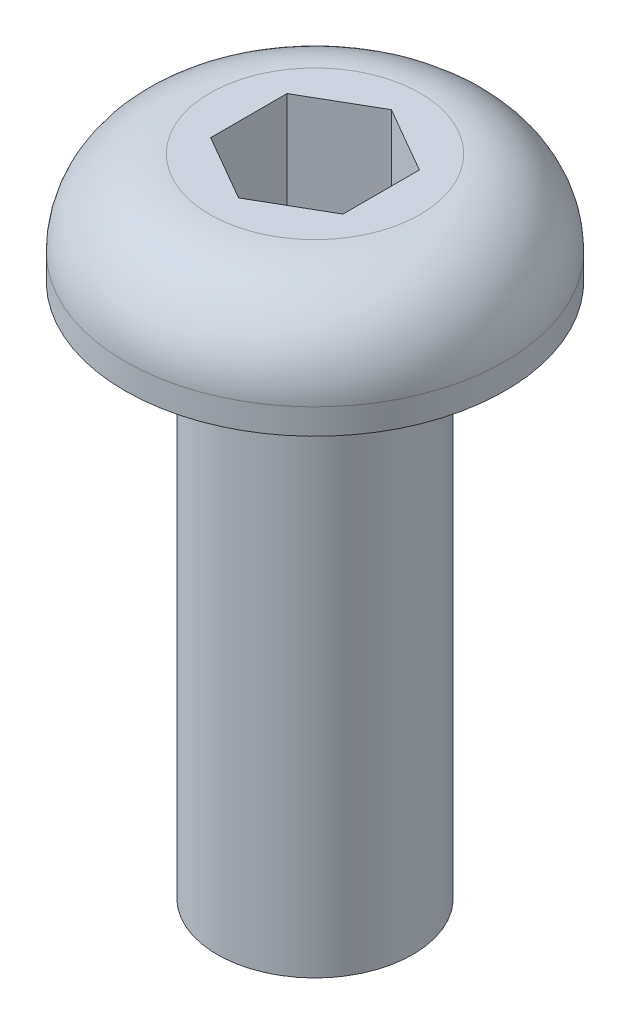
ISO-10303-21;
HEADER;
FILE_DESCRIPTION(('STEP AP214'),'2;1');
FILE_NAME('part.step','',(''),(''),'','','');
FILE_SCHEMA(('AUTOMOTIVE_DESIGN { 1 0 10303 214 1 1 1 1 }'));
ENDSEC;
DATA;
#1=APPLICATION_CONTEXT('core data for automotive mechanical design processes');
#2=APPLICATION_PROTOCOL_DEFINITION('international standard','automotive_design',2000,#1);
#3=PRODUCT_CONTEXT('',#1,'mechanical');
#4=PRODUCT('Part','Part','',(#3));
#5=PRODUCT_RELATED_PRODUCT_CATEGORY('part','',(#4));
#6=PRODUCT_DEFINITION_FORMATION('','',#4);
#7=PRODUCT_DEFINITION_CONTEXT('part definition',#1,'design');
#8=PRODUCT_DEFINITION('design','',#6,#7);
#9=PRODUCT_DEFINITION_SHAPE('','',#8);
#10=(LENGTH_UNIT() NAMED_UNIT(*) SI_UNIT(.MILLI.,.METRE.));
#11=(NAMED_UNIT(*) PLANE_ANGLE_UNIT() SI_UNIT($,.RADIAN.));
#12=(NAMED_UNIT(*) SI_UNIT($,.STERADIAN.) SOLID_ANGLE_UNIT());
#13=UNCERTAINTY_MEASURE_WITH_UNIT(LENGTH_MEASURE(1.E-05),#10,'distance_accuracy_value','');
#14=(GEOMETRIC_REPRESENTATION_CONTEXT(3) GLOBAL_UNCERTAINTY_ASSIGNED_CONTEXT((#13)) GLOBAL_UNIT_ASSIGNED_CONTEXT((#10,
#11,#12)) REPRESENTATION_CONTEXT('',''));
#15=CARTESIAN_POINT('',(0.,0.,0.));
#16=DIRECTION('',(0.,0.,1.));
#17=DIRECTION('',(1.,0.,0.));
#18=AXIS2_PLACEMENT_3D('',#15,#16,#17);
#19=CARTESIAN_POINT('',(0.,0.,0.));
#20=DIRECTION('',(0.,1.,0.));
#21=DIRECTION('',(0.,0.,1.));
#22=AXIS2_PLACEMENT_3D('',#19,#20,#21);
#23=PLANE('',#22);
#24=DIRECTION('',(0.,0.,1.));
#25=VECTOR('',#24,1.);
#26=CARTESIAN_POINT('',(-0.9906,0.,-0.571923176659243));
#27=LINE('',#26,#25);
#28=CARTESIAN_POINT('',(-0.990600000000001,0.,-0.571923176659244));
#29=VERTEX_POINT('',#28);
#30=CARTESIAN_POINT('',(-0.9906,0.,0.571923176659244));
#31=VERTEX_POINT('',#30);
#32=EDGE_CURVE('E97',#29,#31,#27,.T.);
#33=ORIENTED_EDGE('',*,*,#32,.T.);
#34=DIRECTION('',(0.866025403784439,0.,0.5));
#35=VECTOR('',#34,1.);
#36=CARTESIAN_POINT('',(-0.9906,0.,0.571923176659244));
#37=LINE('',#36,#35);
#38=CARTESIAN_POINT('',(0.,0.,1.14384635331849));
#39=VERTEX_POINT('',#38);
#40=EDGE_CURVE('E79',#31,#39,#37,.T.);
#41=ORIENTED_EDGE('',*,*,#40,.T.);
#42=DIRECTION('',(0.866025403784439,0.,-0.5));
#43=VECTOR('',#42,1.);
#44=CARTESIAN_POINT('',(0.,0.,1.14384635331849));
#45=LINE('',#44,#43);
#46=CARTESIAN_POINT('',(0.990600000000001,0.,0.571923176659244));
#47=VERTEX_POINT('',#46);
#48=EDGE_CURVE('E85',#39,#47,#45,.T.);
#49=ORIENTED_EDGE('',*,*,#48,.T.);
#50=DIRECTION('',(0.,0.,-1.));
#51=VECTOR('',#50,1.);
#52=CARTESIAN_POINT('',(0.9906,0.,0.571923176659243));
#53=LINE('',#52,#51);
#54=CARTESIAN_POINT('',(0.990599999999999,0.,-0.571923176659244));
#55=VERTEX_POINT('',#54);
#56=EDGE_CURVE('E155',#47,#55,#53,.T.);
#57=ORIENTED_EDGE('',*,*,#56,.T.);
#58=DIRECTION('',(-0.866025403784439,0.,-0.5));
#59=VECTOR('',#58,1.);
#60=CARTESIAN_POINT('',(0.990599999999999,0.,-0.571923176659244));
#61=LINE('',#60,#59);
#62=CARTESIAN_POINT('',(0.,0.,-1.14384635331849));
#63=VERTEX_POINT('',#62);
#64=EDGE_CURVE('E167',#55,#63,#61,.T.);
#65=ORIENTED_EDGE('',*,*,#64,.T.);
#66=DIRECTION('',(-0.866025403784439,0.,0.5));
#67=VECTOR('',#66,1.);
#68=CARTESIAN_POINT('',(0.,0.,-1.14384635331849));
#69=LINE('',#68,#67);
#70=EDGE_CURVE('E174',#63,#29,#69,.T.);
#71=ORIENTED_EDGE('',*,*,#70,.T.);
#72=EDGE_LOOP('',(#33,#41,#49,#57,#65,#71));
#73=FACE_BOUND('',#72,.T.);
#74=ADVANCED_FACE('F16',(#73),#23,.T.);
#75=CARTESIAN_POINT('',(0.,0.,1.14384635331849));
#76=DIRECTION('',(0.5,0.,0.866025403784439));
#77=DIRECTION('',(0.866025403784439,0.,-0.5));
#78=AXIS2_PLACEMENT_3D('',#75,#76,#77);
#79=PLANE('',#78);
#80=DIRECTION('',(0.,1.,0.));
#81=VECTOR('',#80,1.);
#82=CARTESIAN_POINT('',(0.,0.,1.14384635331849));
#83=LINE('',#82,#81);
#84=CARTESIAN_POINT('',(0.,1.651,1.14384635331849));
#85=VERTEX_POINT('',#84);
#86=EDGE_CURVE('E87',#39,#85,#83,.T.);
#87=ORIENTED_EDGE('',*,*,#86,.T.);
#88=DIRECTION('',(-0.866025403784437,0.,0.500000000000002));
#89=VECTOR('',#88,1.);
#90=CARTESIAN_POINT('',(0.9906,1.651,0.571923176659243));
#91=LINE('',#90,#89);
#92=CARTESIAN_POINT('',(0.990600000000001,1.651,0.571923176659245));
#93=VERTEX_POINT('',#92);
#94=EDGE_CURVE('E163',#93,#85,#91,.T.);
#95=ORIENTED_EDGE('',*,*,#94,.F.);
#96=DIRECTION('',(0.,1.,0.));
#97=VECTOR('',#96,1.);
#98=CARTESIAN_POINT('',(0.9906,0.,0.571923176659243));
#99=LINE('',#98,#97);
#100=EDGE_CURVE('E90',#93,#47,#99,.F.);
#101=ORIENTED_EDGE('',*,*,#100,.T.);
#102=ORIENTED_EDGE('',*,*,#48,.F.);
#103=EDGE_LOOP('',(#87,#95,#101,#102));
#104=FACE_BOUND('',#103,.T.);
#105=ADVANCED_FACE('F86',(#104),#79,.F.);
#106=CARTESIAN_POINT('',(-0.9906,0.,0.571923176659244));
#107=DIRECTION('',(-0.5,0.,0.866025403784439));
#108=DIRECTION('',(0.866025403784439,0.,0.5));
#109=AXIS2_PLACEMENT_3D('',#106,#107,#108);
#110=PLANE('',#109);
#111=DIRECTION('',(0.,1.,0.));
#112=VECTOR('',#111,1.);
#113=CARTESIAN_POINT('',(-0.9906,0.,0.571923176659244));
#114=LINE('',#113,#112);
#115=CARTESIAN_POINT('',(-0.9906,1.651,0.571923176659244));
#116=VERTEX_POINT('',#115);
#117=EDGE_CURVE('E100',#31,#116,#114,.T.);
#118=ORIENTED_EDGE('',*,*,#117,.T.);
#119=DIRECTION('',(-0.866025403784438,0.,-0.500000000000002));
#120=VECTOR('',#119,1.);
#121=CARTESIAN_POINT('',(0.,1.651,1.14384635331849));
#122=LINE('',#121,#120);
#123=EDGE_CURVE('E104',#85,#116,#122,.T.);
#124=ORIENTED_EDGE('',*,*,#123,.F.);
#125=ORIENTED_EDGE('',*,*,#86,.F.);
#126=ORIENTED_EDGE('',*,*,#40,.F.);
#127=EDGE_LOOP('',(#118,#124,#125,#126));
#128=FACE_BOUND('',#127,.T.);
#129=ADVANCED_FACE('F102',(#128),#110,.F.);
#130=CARTESIAN_POINT('',(-0.9906,0.,-0.571923176659243));
#131=DIRECTION('',(-1.,0.,0.));
#132=DIRECTION('',(0.,0.,1.));
#133=AXIS2_PLACEMENT_3D('',#130,#131,#132);
#134=PLANE('',#133);
#135=DIRECTION('',(0.,1.,0.));
#136=VECTOR('',#135,1.);
#137=CARTESIAN_POINT('',(-0.990600000000002,0.,-0.571923176659246));
#138=LINE('',#137,#136);
#139=CARTESIAN_POINT('',(-0.990600000000001,1.651,-0.571923176659244));
#140=VERTEX_POINT('',#139);
#141=EDGE_CURVE('E177',#29,#140,#138,.T.);
#142=ORIENTED_EDGE('',*,*,#141,.T.);
#143=DIRECTION('',(0.,0.,1.));
#144=VECTOR('',#143,1.);
#145=CARTESIAN_POINT('',(-0.9906,1.651,0.));
#146=LINE('',#145,#144);
#147=EDGE_CURVE('E185',#116,#140,#146,.F.);
#148=ORIENTED_EDGE('',*,*,#147,.F.);
#149=ORIENTED_EDGE('',*,*,#117,.F.);
#150=ORIENTED_EDGE('',*,*,#32,.F.);
#151=EDGE_LOOP('',(#142,#148,#149,#150));
#152=FACE_BOUND('',#151,.T.);
#153=ADVANCED_FACE('F186',(#152),#134,.F.);
#154=CARTESIAN_POINT('',(0.,0.,-1.14384635331849));
#155=DIRECTION('',(-0.5,0.,-0.866025403784439));
#156=DIRECTION('',(-0.866025403784439,0.,0.5));
#157=AXIS2_PLACEMENT_3D('',#154,#155,#156);
#158=PLANE('',#157);
#159=DIRECTION('',(0.,1.,0.));
#160=VECTOR('',#159,1.);
#161=CARTESIAN_POINT('',(0.,0.,-1.14384635331849));
#162=LINE('',#161,#160);
#163=CARTESIAN_POINT('',(0.,1.651,-1.14384635331849));
#164=VERTEX_POINT('',#163);
#165=EDGE_CURVE('E171',#63,#164,#162,.T.);
#166=ORIENTED_EDGE('',*,*,#165,.T.);
#167=DIRECTION('',(0.866025403784437,0.,-0.500000000000002));
#168=VECTOR('',#167,1.);
#169=CARTESIAN_POINT('',(-0.9906,1.651,-0.571923176659243));
#170=LINE('',#169,#168);
#171=EDGE_CURVE('E192',#140,#164,#170,.T.);
#172=ORIENTED_EDGE('',*,*,#171,.F.);
#173=ORIENTED_EDGE('',*,*,#141,.F.);
#174=ORIENTED_EDGE('',*,*,#70,.F.);
#175=EDGE_LOOP('',(#166,#172,#173,#174));
#176=FACE_BOUND('',#175,.T.);
#177=ADVANCED_FACE('F218',(#176),#158,.F.);
#178=CARTESIAN_POINT('',(0.990599999999999,0.,-0.571923176659244));
#179=DIRECTION('',(0.5,0.,-0.866025403784439));
#180=DIRECTION('',(-0.866025403784439,0.,-0.5));
#181=AXIS2_PLACEMENT_3D('',#178,#179,#180);
#182=PLANE('',#181);
#183=DIRECTION('',(0.,1.,0.));
#184=VECTOR('',#183,1.);
#185=CARTESIAN_POINT('',(0.9906,0.,-0.571923176659244));
#186=LINE('',#185,#184);
#187=CARTESIAN_POINT('',(0.990599999999999,1.651,-0.571923176659244));
#188=VERTEX_POINT('',#187);
#189=EDGE_CURVE('E39',#55,#188,#186,.T.);
#190=ORIENTED_EDGE('',*,*,#189,.T.);
#191=DIRECTION('',(0.866025403784437,0.,0.500000000000002));
#192=VECTOR('',#191,1.);
#193=CARTESIAN_POINT('',(0.,1.651,-1.14384635331849));
#194=LINE('',#193,#192);
#195=EDGE_CURVE('E203',#164,#188,#194,.T.);
#196=ORIENTED_EDGE('',*,*,#195,.F.);
#197=ORIENTED_EDGE('',*,*,#165,.F.);
#198=ORIENTED_EDGE('',*,*,#64,.F.);
#199=EDGE_LOOP('',(#190,#196,#197,#198));
#200=FACE_BOUND('',#199,.T.);
#201=ADVANCED_FACE('F216',(#200),#182,.F.);
#202=CARTESIAN_POINT('',(0.9906,0.,0.571923176659243));
#203=DIRECTION('',(1.,0.,0.));
#204=DIRECTION('',(0.,0.,-1.));
#205=AXIS2_PLACEMENT_3D('',#202,#203,#204);
#206=PLANE('',#205);
#207=ORIENTED_EDGE('',*,*,#100,.F.);
#208=DIRECTION('',(0.,0.,1.));
#209=VECTOR('',#208,1.);
#210=CARTESIAN_POINT('',(0.990599999999999,1.651,0.));
#211=LINE('',#210,#209);
#212=EDGE_CURVE('E129',#188,#93,#211,.T.);
#213=ORIENTED_EDGE('',*,*,#212,.F.);
#214=ORIENTED_EDGE('',*,*,#189,.F.);
#215=ORIENTED_EDGE('',*,*,#56,.F.);
#216=EDGE_LOOP('',(#207,#213,#214,#215));
#217=FACE_BOUND('',#216,.T.);
#218=ADVANCED_FACE('F214',(#217),#206,.F.);
#219=CARTESIAN_POINT('',(0.,1.651,0.));
#220=DIRECTION('',(0.,1.,0.));
#221=DIRECTION('',(0.,0.,1.));
#222=AXIS2_PLACEMENT_3D('',#219,#220,#221);
#223=PLANE('',#222);
#224=ORIENTED_EDGE('',*,*,#195,.T.);
#225=ORIENTED_EDGE('',*,*,#212,.T.);
#226=ORIENTED_EDGE('',*,*,#94,.T.);
#227=ORIENTED_EDGE('',*,*,#123,.T.);
#228=ORIENTED_EDGE('',*,*,#147,.T.);
#229=ORIENTED_EDGE('',*,*,#171,.T.);
#230=EDGE_LOOP('',(#224,#225,#226,#227,#228,#229));
#231=FACE_BOUND('',#230,.T.);
#232=CARTESIAN_POINT('',(0.,1.651,0.));
#233=DIRECTION('',(0.,-1.,0.));
#234=DIRECTION('',(1.,0.,0.));
#235=AXIS2_PLACEMENT_3D('',#232,#233,#234);
#236=CIRCLE('',#235,1.5748);
#237=CARTESIAN_POINT('',(1.5748,1.651,0.));
#238=VERTEX_POINT('',#237);
#239=EDGE_CURVE('E122',#238,#238,#236,.T.);
#240=ORIENTED_EDGE('',*,*,#239,.F.);
#241=EDGE_LOOP('',(#240));
#242=FACE_BOUND('',#241,.T.);
#243=ADVANCED_FACE('F144',(#231,#242),#223,.T.);
#244=CARTESIAN_POINT('',(0.,0.381,0.));
#245=DIRECTION('',(0.,1.,0.));
#246=DIRECTION('',(0.,0.,1.));
#247=AXIS2_PLACEMENT_3D('',#244,#245,#246);
#248=TOROIDAL_SURFACE('',#247,1.5748,1.27);
#249=ORIENTED_EDGE('',*,*,#239,.T.);
#250=EDGE_LOOP('',(#249));
#251=FACE_BOUND('',#250,.T.);
#252=CARTESIAN_POINT('',(0.,0.381,0.));
#253=DIRECTION('',(0.,1.,0.));
#254=DIRECTION('',(0.,0.,1.));
#255=AXIS2_PLACEMENT_3D('',#252,#253,#254);
#256=CIRCLE('',#255,2.8448);
#257=CARTESIAN_POINT('',(0.,0.381,2.8448));
#258=VERTEX_POINT('',#257);
#259=EDGE_CURVE('E117',#258,#258,#256,.F.);
#260=ORIENTED_EDGE('',*,*,#259,.F.);
#261=EDGE_LOOP('',(#260));
#262=FACE_BOUND('',#261,.T.);
#263=ADVANCED_FACE('F138',(#251,#262),#248,.T.);
#264=CARTESIAN_POINT('',(0.,0.,0.));
#265=DIRECTION('',(0.,1.,0.));
#266=DIRECTION('',(0.,0.,1.));
#267=AXIS2_PLACEMENT_3D('',#264,#265,#266);
#268=CYLINDRICAL_SURFACE('',#267,2.8448);
#269=ORIENTED_EDGE('',*,*,#259,.T.);
#270=EDGE_LOOP('',(#269));
#271=FACE_BOUND('',#270,.T.);
#272=CARTESIAN_POINT('',(0.,0.,0.));
#273=DIRECTION('',(0.,1.,0.));
#274=DIRECTION('',(0.,0.,1.));
#275=AXIS2_PLACEMENT_3D('',#272,#273,#274);
#276=CIRCLE('',#275,2.8448);
#277=CARTESIAN_POINT('',(0.,0.,2.8448));
#278=VERTEX_POINT('',#277);
#279=EDGE_CURVE('E19',#278,#278,#276,.T.);
#280=ORIENTED_EDGE('',*,*,#279,.T.);
#281=EDGE_LOOP('',(#280));
#282=FACE_BOUND('',#281,.T.);
#283=ADVANCED_FACE('F143',(#271,#282),#268,.T.);
#284=CARTESIAN_POINT('',(0.,-8.,0.));
#285=DIRECTION('',(0.,1.,0.));
#286=DIRECTION('',(0.,0.,1.));
#287=AXIS2_PLACEMENT_3D('',#284,#285,#286);
#288=PLANE('',#287);
#289=CARTESIAN_POINT('',(0.,-8.,0.));
#290=DIRECTION('',(0.,-1.,0.));
#291=DIRECTION('',(0.,0.,-1.));
#292=AXIS2_PLACEMENT_3D('',#289,#290,#291);
#293=CIRCLE('',#292,1.4635);
#294=CARTESIAN_POINT('',(0.,-8.,-1.4635));
#295=VERTEX_POINT('',#294);
#296=EDGE_CURVE('E26',#295,#295,#293,.F.);
#297=ORIENTED_EDGE('',*,*,#296,.F.);
#298=EDGE_LOOP('',(#297));
#299=FACE_BOUND('',#298,.T.);
#300=ADVANCED_FACE('F236',(#299),#288,.F.);
#301=CARTESIAN_POINT('',(0.,0.,0.));
#302=DIRECTION('',(0.,1.,0.));
#303=DIRECTION('',(0.,0.,1.));
#304=AXIS2_PLACEMENT_3D('',#301,#302,#303);
#305=PLANE('',#304);
#306=CARTESIAN_POINT('',(0.,0.,0.));
#307=DIRECTION('',(0.,-1.,0.));
#308=DIRECTION('',(0.,0.,-1.));
#309=AXIS2_PLACEMENT_3D('',#306,#307,#308);
#310=CIRCLE('',#309,1.4635);
#311=CARTESIAN_POINT('',(0.,0.,-1.4635));
#312=VERTEX_POINT('',#311);
#313=EDGE_CURVE('E11',#312,#312,#310,.T.);
#314=ORIENTED_EDGE('',*,*,#313,.F.);
#315=EDGE_LOOP('',(#314));
#316=FACE_BOUND('',#315,.T.);
#317=ORIENTED_EDGE('',*,*,#279,.F.);
#318=EDGE_LOOP('',(#317));
#319=FACE_BOUND('',#318,.T.);
#320=ADVANCED_FACE('F230',(#316,#319),#305,.F.);
#321=CARTESIAN_POINT('',(0.,0.,0.));
#322=DIRECTION('',(0.,-1.,0.));
#323=DIRECTION('',(0.,0.,-1.));
#324=AXIS2_PLACEMENT_3D('',#321,#322,#323);
#325=CYLINDRICAL_SURFACE('',#324,1.4635);
#326=ORIENTED_EDGE('',*,*,#313,.T.);
#327=EDGE_LOOP('',(#326));
#328=FACE_BOUND('',#327,.T.);
#329=ORIENTED_EDGE('',*,*,#296,.T.);
#330=EDGE_LOOP('',(#329));
#331=FACE_BOUND('',#330,.T.);
#332=ADVANCED_FACE('F228',(#328,#331),#325,.T.);
#333=CLOSED_SHELL('',(#74,#105,#129,#153,#177,#201,#218,#243,#263,#283,#300,#320,#332));
#334=MANIFOLD_SOLID_BREP('B1',#333);
#335=ADVANCED_BREP_SHAPE_REPRESENTATION('',(#18,#334),#14);
#336=SHAPE_DEFINITION_REPRESENTATION(#9,#335);
ENDSEC;
END-ISO-10303-21;
